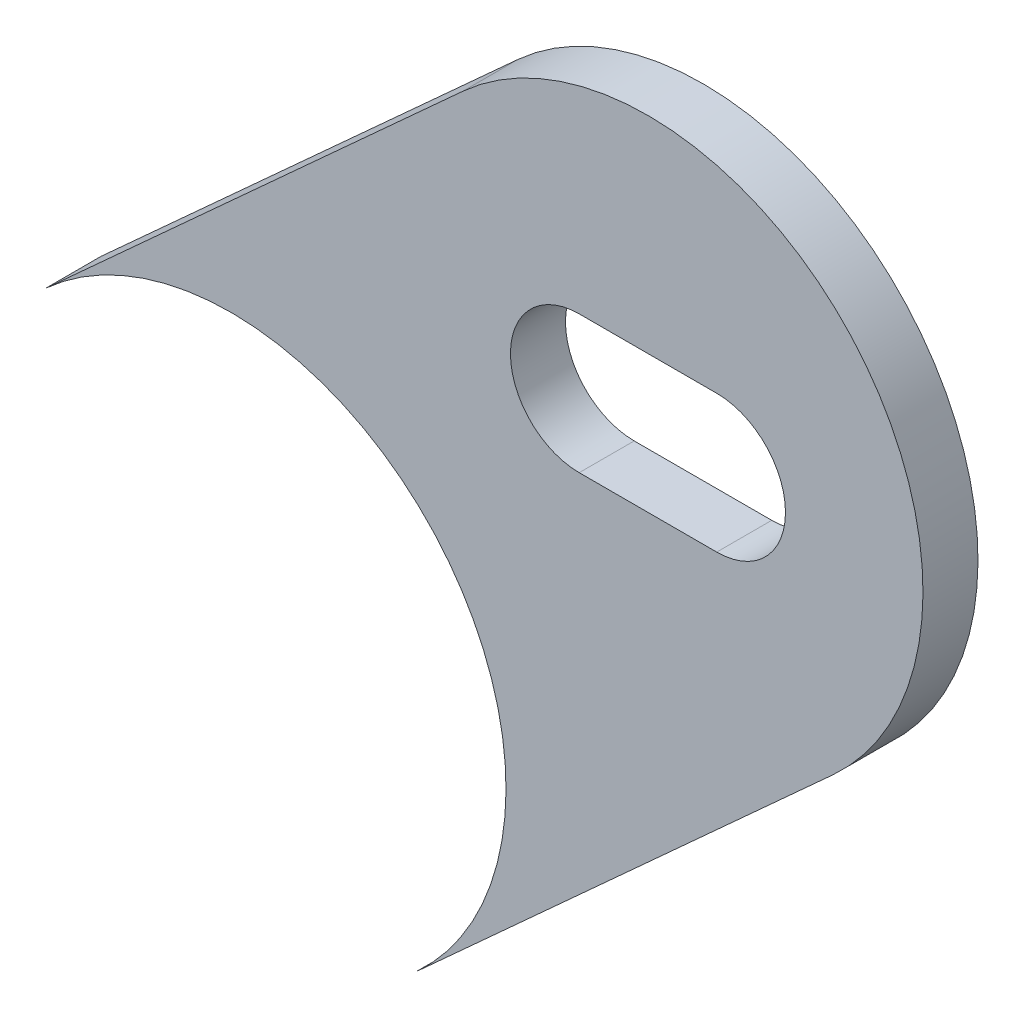
ISO-10303-21;
HEADER;
FILE_DESCRIPTION(('STEP AP214'),'2;1');
FILE_NAME('part.step','',(''),(''),'','','');
FILE_SCHEMA(('AUTOMOTIVE_DESIGN { 1 0 10303 214 1 1 1 1 }'));
ENDSEC;
DATA;
#1=APPLICATION_CONTEXT('core data for automotive mechanical design processes');
#2=APPLICATION_PROTOCOL_DEFINITION('international standard','automotive_design',2000,#1);
#3=PRODUCT_CONTEXT('',#1,'mechanical');
#4=PRODUCT('Part','Part','',(#3));
#5=PRODUCT_RELATED_PRODUCT_CATEGORY('part','',(#4));
#6=PRODUCT_DEFINITION_FORMATION('','',#4);
#7=PRODUCT_DEFINITION_CONTEXT('part definition',#1,'design');
#8=PRODUCT_DEFINITION('design','',#6,#7);
#9=PRODUCT_DEFINITION_SHAPE('','',#8);
#10=(LENGTH_UNIT() NAMED_UNIT(*) SI_UNIT(.MILLI.,.METRE.));
#11=(NAMED_UNIT(*) PLANE_ANGLE_UNIT() SI_UNIT($,.RADIAN.));
#12=(NAMED_UNIT(*) SI_UNIT($,.STERADIAN.) SOLID_ANGLE_UNIT());
#13=UNCERTAINTY_MEASURE_WITH_UNIT(LENGTH_MEASURE(1.E-05),#10,'distance_accuracy_value','');
#14=(GEOMETRIC_REPRESENTATION_CONTEXT(3) GLOBAL_UNCERTAINTY_ASSIGNED_CONTEXT((#13)) GLOBAL_UNIT_ASSIGNED_CONTEXT((#10,
#11,#12)) REPRESENTATION_CONTEXT('',''));
#15=CARTESIAN_POINT('',(0.,0.,0.));
#16=DIRECTION('',(0.,0.,1.));
#17=DIRECTION('',(1.,0.,0.));
#18=AXIS2_PLACEMENT_3D('',#15,#16,#17);
#19=CARTESIAN_POINT('',(-104.376429258047,-76.4776347270015,7.3025));
#20=DIRECTION('',(0.,0.,1.));
#21=DIRECTION('',(1.,0.,0.));
#22=AXIS2_PLACEMENT_3D('',#19,#20,#21);
#23=PLANE('',#22);
#24=CARTESIAN_POINT('',(-104.376429258047,-76.4776347270015,7.3025));
#25=DIRECTION('',(0.,0.,1.));
#26=DIRECTION('',(1.,0.,0.));
#27=AXIS2_PLACEMENT_3D('',#24,#25,#26);
#28=CIRCLE('',#27,12.7);
#29=CARTESIAN_POINT('',(-95.8338858291443,-85.8752382388186,7.3025));
#30=VERTEX_POINT('',#29);
#31=CARTESIAN_POINT('',(-112.918972686949,-67.0800312151845,7.3025));
#32=VERTEX_POINT('',#31);
#33=EDGE_CURVE('E136',#30,#32,#28,.T.);
#34=ORIENTED_EDGE('',*,*,#33,.T.);
#35=DIRECTION('',(-0.739968780458032,-0.67264121487421,0.));
#36=VECTOR('',#35,1.);
#37=CARTESIAN_POINT('',(-132.173225325354,-84.5823964881829,7.3025));
#38=LINE('',#37,#36);
#39=CARTESIAN_POINT('',(-132.173225325354,-84.5823964881829,7.3025));
#40=VERTEX_POINT('',#39);
#41=EDGE_CURVE('E139',#32,#40,#38,.T.);
#42=ORIENTED_EDGE('',*,*,#41,.T.);
#43=CARTESIAN_POINT('',(-123.630681896452,-93.9799999999999,7.3025));
#44=DIRECTION('',(0.,0.,-1.));
#45=DIRECTION('',(-1.,0.,0.));
#46=AXIS2_PLACEMENT_3D('',#43,#44,#45);
#47=CIRCLE('',#46,12.7);
#48=CARTESIAN_POINT('',(-115.088138467549,-103.377603511817,7.3025));
#49=VERTEX_POINT('',#48);
#50=EDGE_CURVE('E142',#40,#49,#47,.T.);
#51=ORIENTED_EDGE('',*,*,#50,.T.);
#52=DIRECTION('',(0.739968780458032,0.67264121487421,0.));
#53=VECTOR('',#52,1.);
#54=CARTESIAN_POINT('',(-115.088138467549,-103.377603511817,7.3025));
#55=LINE('',#54,#53);
#56=EDGE_CURVE('E144',#49,#30,#55,.T.);
#57=ORIENTED_EDGE('',*,*,#56,.T.);
#58=EDGE_LOOP('',(#34,#42,#51,#57));
#59=FACE_BOUND('',#58,.T.);
#60=DIRECTION('',(-1.,0.,0.));
#61=VECTOR('',#60,1.);
#62=CARTESIAN_POINT('',(-107.551429258047,-73.3026347270015,7.3025));
#63=LINE('',#62,#61);
#64=CARTESIAN_POINT('',(-101.201429258047,-73.3026347270015,7.3025));
#65=VERTEX_POINT('',#64);
#66=CARTESIAN_POINT('',(-107.551429258047,-73.3026347270015,7.3025));
#67=VERTEX_POINT('',#66);
#68=EDGE_CURVE('E108',#65,#67,#63,.T.);
#69=ORIENTED_EDGE('',*,*,#68,.F.);
#70=CARTESIAN_POINT('',(-101.201429258047,-76.4776347270015,7.3025));
#71=DIRECTION('',(0.,0.,1.));
#72=DIRECTION('',(-1.,0.,0.));
#73=AXIS2_PLACEMENT_3D('',#70,#71,#72);
#74=CIRCLE('',#73,3.175);
#75=CARTESIAN_POINT('',(-101.201429258047,-79.6526347270015,7.3025));
#76=VERTEX_POINT('',#75);
#77=EDGE_CURVE('E100',#76,#65,#74,.T.);
#78=ORIENTED_EDGE('',*,*,#77,.F.);
#79=DIRECTION('',(1.,0.,0.));
#80=VECTOR('',#79,1.);
#81=CARTESIAN_POINT('',(-107.551429258047,-79.6526347270015,7.3025));
#82=LINE('',#81,#80);
#83=CARTESIAN_POINT('',(-107.551429258047,-79.6526347270015,7.3025));
#84=VERTEX_POINT('',#83);
#85=EDGE_CURVE('E122',#84,#76,#82,.T.);
#86=ORIENTED_EDGE('',*,*,#85,.F.);
#87=CARTESIAN_POINT('',(-107.551429258047,-76.4776347270015,7.3025));
#88=DIRECTION('',(0.,0.,1.));
#89=DIRECTION('',(1.,0.,0.));
#90=AXIS2_PLACEMENT_3D('',#87,#88,#89);
#91=CIRCLE('',#90,3.175);
#92=EDGE_CURVE('E120',#67,#84,#91,.T.);
#93=ORIENTED_EDGE('',*,*,#92,.F.);
#94=EDGE_LOOP('',(#69,#78,#86,#93));
#95=FACE_BOUND('',#94,.T.);
#96=ADVANCED_FACE('F35',(#59,#95),#23,.T.);
#97=CARTESIAN_POINT('',(-104.376429258047,-76.4776347270015,4.7625));
#98=DIRECTION('',(0.,0.,1.));
#99=DIRECTION('',(1.,0.,0.));
#100=AXIS2_PLACEMENT_3D('',#97,#98,#99);
#101=PLANE('',#100);
#102=CARTESIAN_POINT('',(-104.376429258047,-76.4776347270015,4.7625));
#103=DIRECTION('',(0.,0.,1.));
#104=DIRECTION('',(1.,0.,0.));
#105=AXIS2_PLACEMENT_3D('',#102,#103,#104);
#106=CIRCLE('',#105,12.7);
#107=CARTESIAN_POINT('',(-95.8338858291443,-85.8752382388186,4.7625));
#108=VERTEX_POINT('',#107);
#109=CARTESIAN_POINT('',(-112.918972686949,-67.0800312151845,4.7625));
#110=VERTEX_POINT('',#109);
#111=EDGE_CURVE('E116',#108,#110,#106,.T.);
#112=ORIENTED_EDGE('',*,*,#111,.F.);
#113=DIRECTION('',(0.739968780458032,0.67264121487421,0.));
#114=VECTOR('',#113,1.);
#115=CARTESIAN_POINT('',(-115.088138467549,-103.377603511817,4.7625));
#116=LINE('',#115,#114);
#117=CARTESIAN_POINT('',(-115.088138467549,-103.377603511817,4.7625));
#118=VERTEX_POINT('',#117);
#119=EDGE_CURVE('E140',#118,#108,#116,.T.);
#120=ORIENTED_EDGE('',*,*,#119,.F.);
#121=CARTESIAN_POINT('',(-123.630681896452,-93.9799999999999,4.7625));
#122=DIRECTION('',(0.,0.,-1.));
#123=DIRECTION('',(-1.,0.,0.));
#124=AXIS2_PLACEMENT_3D('',#121,#122,#123);
#125=CIRCLE('',#124,12.7);
#126=CARTESIAN_POINT('',(-132.173225325354,-84.5823964881829,4.7625));
#127=VERTEX_POINT('',#126);
#128=EDGE_CURVE('E151',#127,#118,#125,.T.);
#129=ORIENTED_EDGE('',*,*,#128,.F.);
#130=DIRECTION('',(-0.739968780458032,-0.67264121487421,0.));
#131=VECTOR('',#130,1.);
#132=CARTESIAN_POINT('',(-132.173225325354,-84.5823964881829,4.7625));
#133=LINE('',#132,#131);
#134=EDGE_CURVE('E149',#110,#127,#133,.T.);
#135=ORIENTED_EDGE('',*,*,#134,.F.);
#136=EDGE_LOOP('',(#112,#120,#129,#135));
#137=FACE_BOUND('',#136,.T.);
#138=CARTESIAN_POINT('',(-101.201429258047,-76.4776347270015,4.7625));
#139=DIRECTION('',(0.,0.,1.));
#140=DIRECTION('',(-1.,0.,0.));
#141=AXIS2_PLACEMENT_3D('',#138,#139,#140);
#142=CIRCLE('',#141,3.175);
#143=CARTESIAN_POINT('',(-101.201429258047,-79.6526347270015,4.7625));
#144=VERTEX_POINT('',#143);
#145=CARTESIAN_POINT('',(-101.201429258047,-73.3026347270015,4.7625));
#146=VERTEX_POINT('',#145);
#147=EDGE_CURVE('E58',#144,#146,#142,.T.);
#148=ORIENTED_EDGE('',*,*,#147,.T.);
#149=DIRECTION('',(-1.,0.,0.));
#150=VECTOR('',#149,1.);
#151=CARTESIAN_POINT('',(-107.551429258047,-73.3026347270015,4.7625));
#152=LINE('',#151,#150);
#153=CARTESIAN_POINT('',(-107.551429258047,-73.3026347270015,4.7625));
#154=VERTEX_POINT('',#153);
#155=EDGE_CURVE('E115',#146,#154,#152,.T.);
#156=ORIENTED_EDGE('',*,*,#155,.T.);
#157=CARTESIAN_POINT('',(-107.551429258047,-76.4776347270015,4.7625));
#158=DIRECTION('',(0.,0.,1.));
#159=DIRECTION('',(1.,0.,0.));
#160=AXIS2_PLACEMENT_3D('',#157,#158,#159);
#161=CIRCLE('',#160,3.175);
#162=CARTESIAN_POINT('',(-107.551429258047,-79.6526347270015,4.7625));
#163=VERTEX_POINT('',#162);
#164=EDGE_CURVE('E128',#154,#163,#161,.T.);
#165=ORIENTED_EDGE('',*,*,#164,.T.);
#166=DIRECTION('',(1.,0.,0.));
#167=VECTOR('',#166,1.);
#168=CARTESIAN_POINT('',(-107.551429258047,-79.6526347270015,4.7625));
#169=LINE('',#168,#167);
#170=EDGE_CURVE('E109',#163,#144,#169,.T.);
#171=ORIENTED_EDGE('',*,*,#170,.T.);
#172=EDGE_LOOP('',(#148,#156,#165,#171));
#173=FACE_BOUND('',#172,.T.);
#174=ADVANCED_FACE('F169',(#137,#173),#101,.F.);
#175=CARTESIAN_POINT('',(-104.376429258047,-76.4776347270015,7.3025));
#176=DIRECTION('',(0.,0.,-1.));
#177=DIRECTION('',(-1.,0.,0.));
#178=AXIS2_PLACEMENT_3D('',#175,#176,#177);
#179=CYLINDRICAL_SURFACE('',#178,12.7);
#180=ORIENTED_EDGE('',*,*,#111,.T.);
#181=DIRECTION('',(0.,0.,-1.));
#182=VECTOR('',#181,1.);
#183=CARTESIAN_POINT('',(-112.918972686949,-67.0800312151845,7.3025));
#184=LINE('',#183,#182);
#185=EDGE_CURVE('E11',#32,#110,#184,.T.);
#186=ORIENTED_EDGE('',*,*,#185,.F.);
#187=ORIENTED_EDGE('',*,*,#33,.F.);
#188=DIRECTION('',(0.,0.,-1.));
#189=VECTOR('',#188,1.);
#190=CARTESIAN_POINT('',(-95.8338858291443,-85.8752382388186,7.3025));
#191=LINE('',#190,#189);
#192=EDGE_CURVE('E146',#30,#108,#191,.T.);
#193=ORIENTED_EDGE('',*,*,#192,.T.);
#194=EDGE_LOOP('',(#180,#186,#187,#193));
#195=FACE_BOUND('',#194,.T.);
#196=ADVANCED_FACE('F37',(#195),#179,.T.);
#197=CARTESIAN_POINT('',(-132.173225325354,-84.5823964881829,7.3025));
#198=DIRECTION('',(0.67264121487421,-0.739968780458032,0.));
#199=DIRECTION('',(0.739968780458032,0.67264121487421,0.));
#200=AXIS2_PLACEMENT_3D('',#197,#198,#199);
#201=PLANE('',#200);
#202=ORIENTED_EDGE('',*,*,#134,.T.);
#203=DIRECTION('',(0.,0.,-1.));
#204=VECTOR('',#203,1.);
#205=CARTESIAN_POINT('',(-132.173225325354,-84.5823964881829,7.3025));
#206=LINE('',#205,#204);
#207=EDGE_CURVE('E43',#40,#127,#206,.T.);
#208=ORIENTED_EDGE('',*,*,#207,.F.);
#209=ORIENTED_EDGE('',*,*,#41,.F.);
#210=ORIENTED_EDGE('',*,*,#185,.T.);
#211=EDGE_LOOP('',(#202,#208,#209,#210));
#212=FACE_BOUND('',#211,.T.);
#213=ADVANCED_FACE('F179',(#212),#201,.F.);
#214=CARTESIAN_POINT('',(-123.630681896452,-93.9799999999999,7.3025));
#215=DIRECTION('',(0.,0.,-1.));
#216=DIRECTION('',(-1.,0.,0.));
#217=AXIS2_PLACEMENT_3D('',#214,#215,#216);
#218=CYLINDRICAL_SURFACE('',#217,12.7);
#219=ORIENTED_EDGE('',*,*,#128,.T.);
#220=DIRECTION('',(0.,0.,-1.));
#221=VECTOR('',#220,1.);
#222=CARTESIAN_POINT('',(-115.088138467549,-103.377603511817,7.3025));
#223=LINE('',#222,#221);
#224=EDGE_CURVE('E156',#49,#118,#223,.T.);
#225=ORIENTED_EDGE('',*,*,#224,.F.);
#226=ORIENTED_EDGE('',*,*,#50,.F.);
#227=ORIENTED_EDGE('',*,*,#207,.T.);
#228=EDGE_LOOP('',(#219,#225,#226,#227));
#229=FACE_BOUND('',#228,.T.);
#230=ADVANCED_FACE('F163',(#229),#218,.F.);
#231=CARTESIAN_POINT('',(-115.088138467549,-103.377603511817,7.3025));
#232=DIRECTION('',(-0.67264121487421,0.739968780458032,0.));
#233=DIRECTION('',(-0.739968780458032,-0.67264121487421,0.));
#234=AXIS2_PLACEMENT_3D('',#231,#232,#233);
#235=PLANE('',#234);
#236=ORIENTED_EDGE('',*,*,#119,.T.);
#237=ORIENTED_EDGE('',*,*,#192,.F.);
#238=ORIENTED_EDGE('',*,*,#56,.F.);
#239=ORIENTED_EDGE('',*,*,#224,.T.);
#240=EDGE_LOOP('',(#236,#237,#238,#239));
#241=FACE_BOUND('',#240,.T.);
#242=ADVANCED_FACE('F173',(#241),#235,.F.);
#243=CARTESIAN_POINT('',(-101.201429258047,-76.4776347270015,7.3025));
#244=DIRECTION('',(0.,0.,-1.));
#245=DIRECTION('',(-1.,0.,0.));
#246=AXIS2_PLACEMENT_3D('',#243,#244,#245);
#247=CYLINDRICAL_SURFACE('',#246,3.175);
#248=ORIENTED_EDGE('',*,*,#147,.F.);
#249=DIRECTION('',(0.,0.,-1.));
#250=VECTOR('',#249,1.);
#251=CARTESIAN_POINT('',(-101.201429258047,-79.6526347270015,7.3025));
#252=LINE('',#251,#250);
#253=EDGE_CURVE('E104',#76,#144,#252,.T.);
#254=ORIENTED_EDGE('',*,*,#253,.F.);
#255=ORIENTED_EDGE('',*,*,#77,.T.);
#256=DIRECTION('',(0.,0.,-1.));
#257=VECTOR('',#256,1.);
#258=CARTESIAN_POINT('',(-101.201429258047,-73.3026347270015,7.3025));
#259=LINE('',#258,#257);
#260=EDGE_CURVE('E103',#65,#146,#259,.T.);
#261=ORIENTED_EDGE('',*,*,#260,.T.);
#262=EDGE_LOOP('',(#248,#254,#255,#261));
#263=FACE_BOUND('',#262,.T.);
#264=ADVANCED_FACE('F102',(#263),#247,.F.);
#265=CARTESIAN_POINT('',(-107.551429258047,-73.3026347270015,7.3025));
#266=DIRECTION('',(0.,-1.,0.));
#267=DIRECTION('',(0.,0.,-1.));
#268=AXIS2_PLACEMENT_3D('',#265,#266,#267);
#269=PLANE('',#268);
#270=ORIENTED_EDGE('',*,*,#155,.F.);
#271=ORIENTED_EDGE('',*,*,#260,.F.);
#272=ORIENTED_EDGE('',*,*,#68,.T.);
#273=DIRECTION('',(0.,0.,-1.));
#274=VECTOR('',#273,1.);
#275=CARTESIAN_POINT('',(-107.551429258047,-73.3026347270015,7.3025));
#276=LINE('',#275,#274);
#277=EDGE_CURVE('E117',#67,#154,#276,.T.);
#278=ORIENTED_EDGE('',*,*,#277,.T.);
#279=EDGE_LOOP('',(#270,#271,#272,#278));
#280=FACE_BOUND('',#279,.T.);
#281=ADVANCED_FACE('F112',(#280),#269,.T.);
#282=CARTESIAN_POINT('',(-107.551429258047,-76.4776347270015,7.3025));
#283=DIRECTION('',(0.,0.,-1.));
#284=DIRECTION('',(-1.,0.,0.));
#285=AXIS2_PLACEMENT_3D('',#282,#283,#284);
#286=CYLINDRICAL_SURFACE('',#285,3.175);
#287=ORIENTED_EDGE('',*,*,#164,.F.);
#288=ORIENTED_EDGE('',*,*,#277,.F.);
#289=ORIENTED_EDGE('',*,*,#92,.T.);
#290=DIRECTION('',(0.,0.,-1.));
#291=VECTOR('',#290,1.);
#292=CARTESIAN_POINT('',(-107.551429258047,-79.6526347270015,7.3025));
#293=LINE('',#292,#291);
#294=EDGE_CURVE('E50',#84,#163,#293,.T.);
#295=ORIENTED_EDGE('',*,*,#294,.T.);
#296=EDGE_LOOP('',(#287,#288,#289,#295));
#297=FACE_BOUND('',#296,.T.);
#298=ADVANCED_FACE('F202',(#297),#286,.F.);
#299=CARTESIAN_POINT('',(-107.551429258047,-79.6526347270015,7.3025));
#300=DIRECTION('',(0.,1.,0.));
#301=DIRECTION('',(0.,0.,1.));
#302=AXIS2_PLACEMENT_3D('',#299,#300,#301);
#303=PLANE('',#302);
#304=ORIENTED_EDGE('',*,*,#170,.F.);
#305=ORIENTED_EDGE('',*,*,#294,.F.);
#306=ORIENTED_EDGE('',*,*,#85,.T.);
#307=ORIENTED_EDGE('',*,*,#253,.T.);
#308=EDGE_LOOP('',(#304,#305,#306,#307));
#309=FACE_BOUND('',#308,.T.);
#310=ADVANCED_FACE('F206',(#309),#303,.T.);
#311=CLOSED_SHELL('',(#96,#174,#196,#213,#230,#242,#264,#281,#298,#310));
#312=MANIFOLD_SOLID_BREP('B2',#311);
#313=ADVANCED_BREP_SHAPE_REPRESENTATION('',(#18,#312),#14);
#314=SHAPE_DEFINITION_REPRESENTATION(#9,#313);
ENDSEC;
END-ISO-10303-21;
